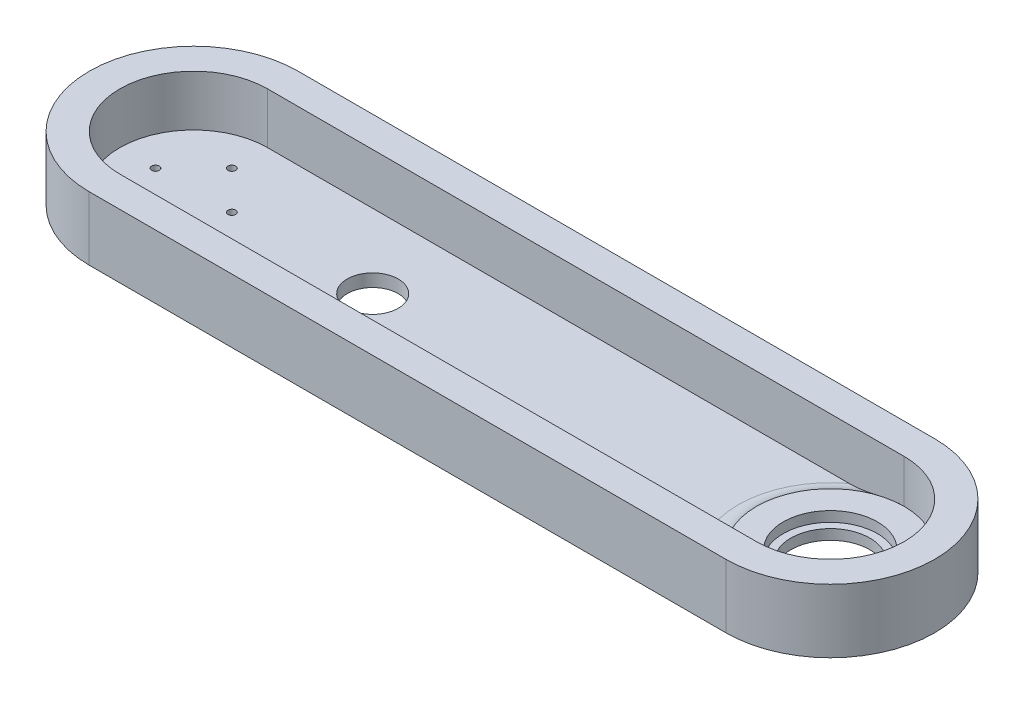
ISO-10303-21;
HEADER;
FILE_DESCRIPTION(('STEP AP214'),'2;1');
FILE_NAME('part.step','',(''),(''),'','','');
FILE_SCHEMA(('AUTOMOTIVE_DESIGN { 1 0 10303 214 1 1 1 1 }'));
ENDSEC;
DATA;
#1=APPLICATION_CONTEXT('core data for automotive mechanical design processes');
#2=APPLICATION_PROTOCOL_DEFINITION('international standard','automotive_design',2000,#1);
#3=PRODUCT_CONTEXT('',#1,'mechanical');
#4=PRODUCT('Part','Part','',(#3));
#5=PRODUCT_RELATED_PRODUCT_CATEGORY('part','',(#4));
#6=PRODUCT_DEFINITION_FORMATION('','',#4);
#7=PRODUCT_DEFINITION_CONTEXT('part definition',#1,'design');
#8=PRODUCT_DEFINITION('design','',#6,#7);
#9=PRODUCT_DEFINITION_SHAPE('','',#8);
#10=(LENGTH_UNIT() NAMED_UNIT(*) SI_UNIT(.MILLI.,.METRE.));
#11=(NAMED_UNIT(*) PLANE_ANGLE_UNIT() SI_UNIT($,.RADIAN.));
#12=(NAMED_UNIT(*) SI_UNIT($,.STERADIAN.) SOLID_ANGLE_UNIT());
#13=UNCERTAINTY_MEASURE_WITH_UNIT(LENGTH_MEASURE(1.E-05),#10,'distance_accuracy_value','');
#14=(GEOMETRIC_REPRESENTATION_CONTEXT(3) GLOBAL_UNCERTAINTY_ASSIGNED_CONTEXT((#13)) GLOBAL_UNIT_ASSIGNED_CONTEXT((#10,
#11,#12)) REPRESENTATION_CONTEXT('',''));
#15=CARTESIAN_POINT('',(0.,0.,0.));
#16=DIRECTION('',(0.,0.,1.));
#17=DIRECTION('',(1.,0.,0.));
#18=AXIS2_PLACEMENT_3D('',#15,#16,#17);
#19=CARTESIAN_POINT('',(0.,0.,0.));
#20=DIRECTION('',(0.,1.,0.));
#21=DIRECTION('',(0.,0.,1.));
#22=AXIS2_PLACEMENT_3D('',#19,#20,#21);
#23=PLANE('',#22);
#24=CARTESIAN_POINT('',(70.3,0.,0.));
#25=DIRECTION('',(0.,1.,0.));
#26=DIRECTION('',(0.,0.,1.));
#27=AXIS2_PLACEMENT_3D('',#24,#25,#26);
#28=CIRCLE('',#27,9.99999999999999);
#29=CARTESIAN_POINT('',(70.3,0.,9.99999999999999));
#30=VERTEX_POINT('',#29);
#31=EDGE_CURVE('E186',#30,#30,#28,.T.);
#32=ORIENTED_EDGE('',*,*,#31,.F.);
#33=EDGE_LOOP('',(#32));
#34=FACE_BOUND('',#33,.T.);
#35=CARTESIAN_POINT('',(15.0000000000004,0.,-4.24488671257339E-13));
#36=DIRECTION('',(0.,1.,0.));
#37=DIRECTION('',(0.,0.,1.));
#38=AXIS2_PLACEMENT_3D('',#35,#36,#37);
#39=CIRCLE('',#38,1.50000000000033);
#40=CARTESIAN_POINT('',(15.0000000000004,0.,1.49999999999991));
#41=VERTEX_POINT('',#40);
#42=EDGE_CURVE('E190',#41,#41,#39,.T.);
#43=ORIENTED_EDGE('',*,*,#42,.F.);
#44=EDGE_LOOP('',(#43));
#45=FACE_BOUND('',#44,.T.);
#46=CARTESIAN_POINT('',(8.48977342514678E-13,0.,15.));
#47=DIRECTION('',(0.,1.,0.));
#48=DIRECTION('',(0.,0.,1.));
#49=AXIS2_PLACEMENT_3D('',#46,#47,#48);
#50=CIRCLE('',#49,1.50000000000091);
#51=CARTESIAN_POINT('',(8.48977342514678E-13,0.,16.5000000000009));
#52=VERTEX_POINT('',#51);
#53=EDGE_CURVE('E194',#52,#52,#50,.T.);
#54=ORIENTED_EDGE('',*,*,#53,.F.);
#55=EDGE_LOOP('',(#54));
#56=FACE_BOUND('',#55,.T.);
#57=CARTESIAN_POINT('',(-14.9999999999996,0.,4.2632564145606E-13));
#58=DIRECTION('',(0.,1.,0.));
#59=DIRECTION('',(0.,0.,1.));
#60=AXIS2_PLACEMENT_3D('',#57,#58,#59);
#61=CIRCLE('',#60,1.50000000000068);
#62=CARTESIAN_POINT('',(-14.9999999999996,0.,1.50000000000111));
#63=VERTEX_POINT('',#62);
#64=EDGE_CURVE('E198',#63,#63,#61,.T.);
#65=ORIENTED_EDGE('',*,*,#64,.F.);
#66=EDGE_LOOP('',(#65));
#67=FACE_BOUND('',#66,.T.);
#68=CARTESIAN_POINT('',(0.,0.,-15.));
#69=DIRECTION('',(0.,1.,0.));
#70=DIRECTION('',(0.,0.,1.));
#71=AXIS2_PLACEMENT_3D('',#68,#69,#70);
#72=CIRCLE('',#71,1.5);
#73=CARTESIAN_POINT('',(0.,0.,-13.5));
#74=VERTEX_POINT('',#73);
#75=EDGE_CURVE('E201',#74,#74,#72,.T.);
#76=ORIENTED_EDGE('',*,*,#75,.F.);
#77=EDGE_LOOP('',(#76));
#78=FACE_BOUND('',#77,.T.);
#79=DIRECTION('',(1.,0.,0.));
#80=VECTOR('',#79,1.);
#81=CARTESIAN_POINT('',(0.,0.,29.));
#82=LINE('',#81,#80);
#83=CARTESIAN_POINT('',(0.,0.,29.));
#84=VERTEX_POINT('',#83);
#85=CARTESIAN_POINT('',(228.431438414779,0.,29.));
#86=VERTEX_POINT('',#85);
#87=EDGE_CURVE('E203',#84,#86,#82,.T.);
#88=ORIENTED_EDGE('',*,*,#87,.T.);
#89=CARTESIAN_POINT('',(250.,0.,0.));
#90=DIRECTION('',(0.,1.,0.));
#91=DIRECTION('',(0.,0.,1.));
#92=AXIS2_PLACEMENT_3D('',#89,#90,#91);
#93=CIRCLE('',#92,36.1414284285429);
#94=CARTESIAN_POINT('',(228.431438414779,0.,-29.));
#95=VERTEX_POINT('',#94);
#96=EDGE_CURVE('E130',#86,#95,#93,.F.);
#97=ORIENTED_EDGE('',*,*,#96,.T.);
#98=DIRECTION('',(-1.,0.,0.));
#99=VECTOR('',#98,1.);
#100=CARTESIAN_POINT('',(0.,0.,-29.));
#101=LINE('',#100,#99);
#102=CARTESIAN_POINT('',(0.,0.,-29.));
#103=VERTEX_POINT('',#102);
#104=EDGE_CURVE('E207',#95,#103,#101,.T.);
#105=ORIENTED_EDGE('',*,*,#104,.T.);
#106=CARTESIAN_POINT('',(0.,0.,0.));
#107=DIRECTION('',(0.,1.,0.));
#108=DIRECTION('',(0.,0.,1.));
#109=AXIS2_PLACEMENT_3D('',#106,#107,#108);
#110=CIRCLE('',#109,29.);
#111=EDGE_CURVE('E205',#103,#84,#110,.T.);
#112=ORIENTED_EDGE('',*,*,#111,.T.);
#113=EDGE_LOOP('',(#88,#97,#105,#112));
#114=FACE_BOUND('',#113,.T.);
#115=ADVANCED_FACE('F35',(#34,#45,#56,#67,#78,#114),#23,.T.);
#116=CARTESIAN_POINT('',(0.,20.,0.));
#117=DIRECTION('',(0.,1.,0.));
#118=DIRECTION('',(0.,0.,1.));
#119=AXIS2_PLACEMENT_3D('',#116,#117,#118);
#120=PLANE('',#119);
#121=CARTESIAN_POINT('',(0.,20.,0.));
#122=DIRECTION('',(0.,1.,0.));
#123=DIRECTION('',(0.,0.,1.));
#124=AXIS2_PLACEMENT_3D('',#121,#122,#123);
#125=CIRCLE('',#124,41.);
#126=CARTESIAN_POINT('',(0.,20.,-41.));
#127=VERTEX_POINT('',#126);
#128=CARTESIAN_POINT('',(0.,20.,41.));
#129=VERTEX_POINT('',#128);
#130=EDGE_CURVE('E221',#127,#129,#125,.T.);
#131=ORIENTED_EDGE('',*,*,#130,.T.);
#132=DIRECTION('',(1.,0.,0.));
#133=VECTOR('',#132,1.);
#134=CARTESIAN_POINT('',(0.,20.,41.));
#135=LINE('',#134,#133);
#136=CARTESIAN_POINT('',(250.,20.,41.));
#137=VERTEX_POINT('',#136);
#138=EDGE_CURVE('E224',#129,#137,#135,.T.);
#139=ORIENTED_EDGE('',*,*,#138,.T.);
#140=CARTESIAN_POINT('',(250.,20.,0.));
#141=DIRECTION('',(0.,1.,0.));
#142=DIRECTION('',(0.,0.,1.));
#143=AXIS2_PLACEMENT_3D('',#140,#141,#142);
#144=CIRCLE('',#143,41.);
#145=CARTESIAN_POINT('',(250.,20.,-41.));
#146=VERTEX_POINT('',#145);
#147=EDGE_CURVE('E226',#137,#146,#144,.T.);
#148=ORIENTED_EDGE('',*,*,#147,.T.);
#149=DIRECTION('',(-1.,0.,0.));
#150=VECTOR('',#149,1.);
#151=CARTESIAN_POINT('',(0.,20.,-41.));
#152=LINE('',#151,#150);
#153=EDGE_CURVE('E228',#146,#127,#152,.T.);
#154=ORIENTED_EDGE('',*,*,#153,.T.);
#155=EDGE_LOOP('',(#131,#139,#148,#154));
#156=FACE_BOUND('',#155,.T.);
#157=DIRECTION('',(1.,0.,0.));
#158=VECTOR('',#157,1.);
#159=CARTESIAN_POINT('',(0.,20.,29.));
#160=LINE('',#159,#158);
#161=CARTESIAN_POINT('',(0.,20.,29.));
#162=VERTEX_POINT('',#161);
#163=CARTESIAN_POINT('',(250.,20.,29.));
#164=VERTEX_POINT('',#163);
#165=EDGE_CURVE('E127',#162,#164,#160,.T.);
#166=ORIENTED_EDGE('',*,*,#165,.F.);
#167=CARTESIAN_POINT('',(0.,20.,0.));
#168=DIRECTION('',(0.,1.,0.));
#169=DIRECTION('',(0.,0.,1.));
#170=AXIS2_PLACEMENT_3D('',#167,#168,#169);
#171=CIRCLE('',#170,29.);
#172=CARTESIAN_POINT('',(0.,20.,-29.));
#173=VERTEX_POINT('',#172);
#174=EDGE_CURVE('E209',#173,#162,#171,.T.);
#175=ORIENTED_EDGE('',*,*,#174,.F.);
#176=DIRECTION('',(-1.,0.,0.));
#177=VECTOR('',#176,1.);
#178=CARTESIAN_POINT('',(0.,20.,-29.));
#179=LINE('',#178,#177);
#180=CARTESIAN_POINT('',(250.,20.,-29.));
#181=VERTEX_POINT('',#180);
#182=EDGE_CURVE('E218',#181,#173,#179,.T.);
#183=ORIENTED_EDGE('',*,*,#182,.F.);
#184=CARTESIAN_POINT('',(250.,20.,0.));
#185=DIRECTION('',(0.,1.,0.));
#186=DIRECTION('',(0.,0.,1.));
#187=AXIS2_PLACEMENT_3D('',#184,#185,#186);
#188=CIRCLE('',#187,29.);
#189=EDGE_CURVE('E260',#164,#181,#188,.T.);
#190=ORIENTED_EDGE('',*,*,#189,.F.);
#191=EDGE_LOOP('',(#166,#175,#183,#190));
#192=FACE_BOUND('',#191,.T.);
#193=ADVANCED_FACE('F160',(#156,#192),#120,.T.);
#194=CARTESIAN_POINT('',(0.,20.,0.));
#195=DIRECTION('',(0.,-1.,0.));
#196=DIRECTION('',(0.,0.,-1.));
#197=AXIS2_PLACEMENT_3D('',#194,#195,#196);
#198=CYLINDRICAL_SURFACE('',#197,41.);
#199=DIRECTION('',(0.,-1.,0.));
#200=VECTOR('',#199,1.);
#201=CARTESIAN_POINT('',(0.,20.,-41.));
#202=LINE('',#201,#200);
#203=CARTESIAN_POINT('',(0.,-5.,-41.));
#204=VERTEX_POINT('',#203);
#205=EDGE_CURVE('E230',#127,#204,#202,.T.);
#206=ORIENTED_EDGE('',*,*,#205,.T.);
#207=CARTESIAN_POINT('',(0.,-5.,0.));
#208=DIRECTION('',(0.,1.,0.));
#209=DIRECTION('',(0.,0.,1.));
#210=AXIS2_PLACEMENT_3D('',#207,#208,#209);
#211=CIRCLE('',#210,41.);
#212=CARTESIAN_POINT('',(0.,-5.,41.));
#213=VERTEX_POINT('',#212);
#214=EDGE_CURVE('E211',#204,#213,#211,.T.);
#215=ORIENTED_EDGE('',*,*,#214,.T.);
#216=DIRECTION('',(0.,-1.,0.));
#217=VECTOR('',#216,1.);
#218=CARTESIAN_POINT('',(0.,20.,41.));
#219=LINE('',#218,#217);
#220=EDGE_CURVE('E133',#129,#213,#219,.T.);
#221=ORIENTED_EDGE('',*,*,#220,.F.);
#222=ORIENTED_EDGE('',*,*,#130,.F.);
#223=EDGE_LOOP('',(#206,#215,#221,#222));
#224=FACE_BOUND('',#223,.T.);
#225=ADVANCED_FACE('F163',(#224),#198,.T.);
#226=CARTESIAN_POINT('',(0.,20.,41.));
#227=DIRECTION('',(0.,0.,-1.));
#228=DIRECTION('',(-1.,0.,0.));
#229=AXIS2_PLACEMENT_3D('',#226,#227,#228);
#230=PLANE('',#229);
#231=ORIENTED_EDGE('',*,*,#220,.T.);
#232=DIRECTION('',(1.,0.,0.));
#233=VECTOR('',#232,1.);
#234=CARTESIAN_POINT('',(0.,-5.,41.));
#235=LINE('',#234,#233);
#236=CARTESIAN_POINT('',(250.,-5.,41.));
#237=VERTEX_POINT('',#236);
#238=EDGE_CURVE('E245',#213,#237,#235,.T.);
#239=ORIENTED_EDGE('',*,*,#238,.T.);
#240=DIRECTION('',(0.,-1.,0.));
#241=VECTOR('',#240,1.);
#242=CARTESIAN_POINT('',(250.,20.,41.));
#243=LINE('',#242,#241);
#244=EDGE_CURVE('E135',#137,#237,#243,.T.);
#245=ORIENTED_EDGE('',*,*,#244,.F.);
#246=ORIENTED_EDGE('',*,*,#138,.F.);
#247=EDGE_LOOP('',(#231,#239,#245,#246));
#248=FACE_BOUND('',#247,.T.);
#249=ADVANCED_FACE('F171',(#248),#230,.F.);
#250=CARTESIAN_POINT('',(250.,20.,0.));
#251=DIRECTION('',(0.,-1.,0.));
#252=DIRECTION('',(0.,0.,-1.));
#253=AXIS2_PLACEMENT_3D('',#250,#251,#252);
#254=CYLINDRICAL_SURFACE('',#253,41.);
#255=ORIENTED_EDGE('',*,*,#244,.T.);
#256=CARTESIAN_POINT('',(250.,-5.,0.));
#257=DIRECTION('',(0.,1.,0.));
#258=DIRECTION('',(0.,0.,1.));
#259=AXIS2_PLACEMENT_3D('',#256,#257,#258);
#260=CIRCLE('',#259,41.);
#261=CARTESIAN_POINT('',(250.,-5.,-41.));
#262=VERTEX_POINT('',#261);
#263=EDGE_CURVE('E239',#237,#262,#260,.T.);
#264=ORIENTED_EDGE('',*,*,#263,.T.);
#265=DIRECTION('',(0.,-1.,0.));
#266=VECTOR('',#265,1.);
#267=CARTESIAN_POINT('',(250.,20.,-41.));
#268=LINE('',#267,#266);
#269=EDGE_CURVE('E232',#146,#262,#268,.T.);
#270=ORIENTED_EDGE('',*,*,#269,.F.);
#271=ORIENTED_EDGE('',*,*,#147,.F.);
#272=EDGE_LOOP('',(#255,#264,#270,#271));
#273=FACE_BOUND('',#272,.T.);
#274=ADVANCED_FACE('F167',(#273),#254,.T.);
#275=CARTESIAN_POINT('',(0.,20.,-41.));
#276=DIRECTION('',(0.,0.,1.));
#277=DIRECTION('',(1.,0.,0.));
#278=AXIS2_PLACEMENT_3D('',#275,#276,#277);
#279=PLANE('',#278);
#280=ORIENTED_EDGE('',*,*,#269,.T.);
#281=DIRECTION('',(1.,0.,0.));
#282=VECTOR('',#281,1.);
#283=CARTESIAN_POINT('',(0.,-5.,-41.));
#284=LINE('',#283,#282);
#285=EDGE_CURVE('E248',#204,#262,#284,.T.);
#286=ORIENTED_EDGE('',*,*,#285,.F.);
#287=ORIENTED_EDGE('',*,*,#205,.F.);
#288=ORIENTED_EDGE('',*,*,#153,.F.);
#289=EDGE_LOOP('',(#280,#286,#287,#288));
#290=FACE_BOUND('',#289,.T.);
#291=ADVANCED_FACE('F158',(#290),#279,.F.);
#292=CARTESIAN_POINT('',(0.,20.,0.));
#293=DIRECTION('',(0.,-1.,0.));
#294=DIRECTION('',(0.,0.,-1.));
#295=AXIS2_PLACEMENT_3D('',#292,#293,#294);
#296=CYLINDRICAL_SURFACE('',#295,29.);
#297=ORIENTED_EDGE('',*,*,#111,.F.);
#298=DIRECTION('',(0.,-1.,0.));
#299=VECTOR('',#298,1.);
#300=CARTESIAN_POINT('',(0.,20.,-29.));
#301=LINE('',#300,#299);
#302=EDGE_CURVE('E215',#173,#103,#301,.T.);
#303=ORIENTED_EDGE('',*,*,#302,.F.);
#304=ORIENTED_EDGE('',*,*,#174,.T.);
#305=DIRECTION('',(0.,-1.,0.));
#306=VECTOR('',#305,1.);
#307=CARTESIAN_POINT('',(0.,20.,29.));
#308=LINE('',#307,#306);
#309=EDGE_CURVE('E128',#162,#84,#308,.T.);
#310=ORIENTED_EDGE('',*,*,#309,.T.);
#311=EDGE_LOOP('',(#297,#303,#304,#310));
#312=FACE_BOUND('',#311,.T.);
#313=ADVANCED_FACE('F155',(#312),#296,.F.);
#314=CARTESIAN_POINT('',(0.,20.,29.));
#315=DIRECTION('',(0.,0.,-1.));
#316=DIRECTION('',(-1.,0.,0.));
#317=AXIS2_PLACEMENT_3D('',#314,#315,#316);
#318=PLANE('',#317);
#319=DIRECTION('',(0.,-1.,0.));
#320=VECTOR('',#319,1.);
#321=CARTESIAN_POINT('',(250.,20.,29.));
#322=LINE('',#321,#320);
#323=CARTESIAN_POINT('',(250.,3.,29.));
#324=VERTEX_POINT('',#323);
#325=EDGE_CURVE('E120',#164,#324,#322,.T.);
#326=ORIENTED_EDGE('',*,*,#325,.T.);
#327=CARTESIAN_POINT('',(250.,3.,29.));
#328=CARTESIAN_POINT('',(249.832493377356,3.00000367263061,29.));
#329=CARTESIAN_POINT('',(249.664990380621,2.9985188998757,29.));
#330=CARTESIAN_POINT('',(249.330039269559,2.99260478049942,29.));
#331=CARTESIAN_POINT('',(249.162591154308,2.98817548631364,29.));
#332=CARTESIAN_POINT('',(248.660485564545,2.97052251778616,29.));
#333=CARTESIAN_POINT('',(248.325972797857,2.95293372283741,29.));
#334=CARTESIAN_POINT('',(247.658627091689,2.90682313871172,29.));
#335=CARTESIAN_POINT('',(247.325792055736,2.87833103675042,29.));
#336=CARTESIAN_POINT('',(246.66111223066,2.81140950416254,29.));
#337=CARTESIAN_POINT('',(246.329267499912,2.77297949898823,29.));
#338=CARTESIAN_POINT('',(245.666817846843,2.687443630777,29.));
#339=CARTESIAN_POINT('',(245.336212562984,2.64034053760958,29.));
#340=CARTESIAN_POINT('',(244.67613608256,2.53884149075314,29.));
#341=CARTESIAN_POINT('',(244.346664878401,2.48444558599467,29.));
#342=CARTESIAN_POINT('',(243.359155528962,2.3123953016813,29.));
#343=CARTESIAN_POINT('',(242.702660035545,2.18596637017266,29.));
#344=CARTESIAN_POINT('',(241.485079640582,1.9399674063863,29.));
#345=CARTESIAN_POINT('',(240.923664748939,1.82196657385981,29.));
#346=CARTESIAN_POINT('',(239.801276777676,1.58383209028963,29.));
#347=CARTESIAN_POINT('',(239.24030370541,1.46369840449079,29.));
#348=CARTESIAN_POINT('',(238.11825457787,1.22748824284378,29.));
#349=CARTESIAN_POINT('',(237.557179606503,1.11140669088967,29.));
#350=CARTESIAN_POINT('',(236.433103705994,0.888636585884137,29.));
#351=CARTESIAN_POINT('',(235.870102667029,0.781948578042807,29.));
#352=CARTESIAN_POINT('',(234.739695176278,0.582831670789539,29.));
#353=CARTESIAN_POINT('',(234.172280414024,0.490449095875529,29.));
#354=CARTESIAN_POINT('',(233.034603708037,0.325419015592739,29.));
#355=CARTESIAN_POINT('',(232.464342082054,0.252769355783526,29.));
#356=CARTESIAN_POINT('',(231.318178299336,0.131906466672462,29.));
#357=CARTESIAN_POINT('',(230.742262210227,0.0838200060385131,29.));
#358=CARTESIAN_POINT('',(229.588148024831,0.0178691349203777,29.));
#359=CARTESIAN_POINT('',(229.009948180689,3.61368821550616E-05,29.));
#360=CARTESIAN_POINT('',(228.431438414779,0.,29.));
#361=B_SPLINE_CURVE_WITH_KNOTS('',3,(#327,#328,#329,#330,#331,#332,#333,#334,#335,#336,#337,
#338,#339,#340,#341,#342,#343,#344,#345,#346,#347,#348,#349,#350,#351,#352,#353,#354,#355,#356,
#357,#358,#359,#360),.UNSPECIFIED.,.F.,.F.,(4,2,2,2,2,2,2,2,2,2,2,2,2,2,2,2,4),(0.,
0.502506265709881,1.00500358310246,2.00971623130642,3.01171251944555,4.0137667497312,
5.01550151358301,6.01722955671074,8.02261757938016,9.74366545617356,11.4647414034875,
13.1835777648582,14.9025138234281,16.6269047818956,18.3511073955454,20.0841207854072,
21.8189324800552),.UNSPECIFIED.);
#362=EDGE_CURVE('E11',#324,#86,#361,.T.);
#363=ORIENTED_EDGE('',*,*,#362,.T.);
#364=ORIENTED_EDGE('',*,*,#87,.F.);
#365=ORIENTED_EDGE('',*,*,#309,.F.);
#366=ORIENTED_EDGE('',*,*,#165,.T.);
#367=EDGE_LOOP('',(#326,#363,#364,#365,#366));
#368=FACE_BOUND('',#367,.T.);
#369=ADVANCED_FACE('F124',(#368),#318,.T.);
#370=CARTESIAN_POINT('',(250.,20.,0.));
#371=DIRECTION('',(0.,-1.,0.));
#372=DIRECTION('',(0.,0.,-1.));
#373=AXIS2_PLACEMENT_3D('',#370,#371,#372);
#374=CYLINDRICAL_SURFACE('',#373,29.);
#375=CARTESIAN_POINT('',(250.,3.,0.));
#376=DIRECTION('',(0.,1.,0.));
#377=DIRECTION('',(0.,0.,1.));
#378=AXIS2_PLACEMENT_3D('',#375,#376,#377);
#379=CIRCLE('',#378,29.);
#380=CARTESIAN_POINT('',(250.,3.,-29.));
#381=VERTEX_POINT('',#380);
#382=EDGE_CURVE('E112',#324,#381,#379,.T.);
#383=ORIENTED_EDGE('',*,*,#382,.F.);
#384=ORIENTED_EDGE('',*,*,#325,.F.);
#385=ORIENTED_EDGE('',*,*,#189,.T.);
#386=DIRECTION('',(0.,-1.,0.));
#387=VECTOR('',#386,1.);
#388=CARTESIAN_POINT('',(250.,20.,-29.));
#389=LINE('',#388,#387);
#390=EDGE_CURVE('E122',#181,#381,#389,.T.);
#391=ORIENTED_EDGE('',*,*,#390,.T.);
#392=EDGE_LOOP('',(#383,#384,#385,#391));
#393=FACE_BOUND('',#392,.T.);
#394=ADVANCED_FACE('F118',(#393),#374,.F.);
#395=CARTESIAN_POINT('',(0.,20.,-29.));
#396=DIRECTION('',(0.,0.,1.));
#397=DIRECTION('',(1.,0.,0.));
#398=AXIS2_PLACEMENT_3D('',#395,#396,#397);
#399=PLANE('',#398);
#400=ORIENTED_EDGE('',*,*,#104,.F.);
#401=CARTESIAN_POINT('',(228.431438414779,0.,-29.));
#402=CARTESIAN_POINT('',(228.7712509574,5.30773564091231E-06,-29.));
#403=CARTESIAN_POINT('',(229.111011404756,0.00616809285598318,-29.));
#404=CARTESIAN_POINT('',(229.790063460882,0.0297169154421981,-29.));
#405=CARTESIAN_POINT('',(230.12935516613,0.0471001277119732,-29.));
#406=CARTESIAN_POINT('',(231.145021725049,0.114368246206919,-29.));
#407=CARTESIAN_POINT('',(231.820408098775,0.179379530768059,-29.));
#408=CARTESIAN_POINT('',(233.166581031963,0.341322058111444,-29.));
#409=CARTESIAN_POINT('',(233.837370986746,0.438226368006113,-29.));
#410=CARTESIAN_POINT('',(235.175465990828,0.655818383972155,-29.));
#411=CARTESIAN_POINT('',(235.842768362181,0.776522207382179,-29.));
#412=CARTESIAN_POINT('',(237.067227847358,1.01257222818366,-29.));
#413=CARTESIAN_POINT('',(237.624832005435,1.12565569701959,-29.));
#414=CARTESIAN_POINT('',(238.738898691866,1.35731126230573,-29.));
#415=CARTESIAN_POINT('',(239.295361193068,1.47588348775472,-29.));
#416=CARTESIAN_POINT('',(240.407722646888,1.71266395535803,-29.));
#417=CARTESIAN_POINT('',(240.963621546068,1.83087245442479,-29.));
#418=CARTESIAN_POINT('',(242.076843467326,2.06078866897682,-29.));
#419=CARTESIAN_POINT('',(242.634166613534,2.17249579616322,-29.));
#420=CARTESIAN_POINT('',(243.75274612407,2.38278730883891,-29.));
#421=CARTESIAN_POINT('',(244.314008777347,2.48133889697814,-29.));
#422=CARTESIAN_POINT('',(245.439682547898,2.65769097186664,-29.));
#423=CARTESIAN_POINT('',(246.00409235969,2.73549949164326,-29.));
#424=CARTESIAN_POINT('',(246.854489630497,2.83177237456654,-29.));
#425=CARTESIAN_POINT('',(247.139322428893,2.86050396734676,-29.));
#426=CARTESIAN_POINT('',(247.709654232686,2.91033660830311,-29.));
#427=CARTESIAN_POINT('',(247.995153217051,2.93143789418972,-29.));
#428=CARTESIAN_POINT('',(248.567059884556,2.96546191387092,-29.));
#429=CARTESIAN_POINT('',(248.853468285594,2.97837268727966,-29.));
#430=CARTESIAN_POINT('',(249.426581429478,2.9956631071147,-29.));
#431=CARTESIAN_POINT('',(249.713286208416,3.00004155034541,-29.));
#432=CARTESIAN_POINT('',(250.,2.99999999999964,-29.));
#433=B_SPLINE_CURVE_WITH_KNOTS('',3,(#401,#402,#403,#404,#405,#406,#407,#408,#409,#410,#411,
#412,#413,#414,#415,#416,#417,#418,#419,#420,#421,#422,#423,#424,#425,#426,#427,#428,#429,#430,
#431,#432),.UNSPECIFIED.,.F.,.F.,(4,2,2,2,2,2,2,2,2,2,2,2,2,2,2,4),(0.,1.01929970871869,
2.03834286759517,4.07277543747311,6.10549436775049,8.13959463914237,9.84641472354875,
11.5532749426588,13.2582575624579,14.9633942243308,16.6727054911769,18.3813538398808,
19.2401015696126,20.098822544074,20.9587946166991,21.8188879504262),.UNSPECIFIED.);
#434=EDGE_CURVE('E48',#95,#381,#433,.T.);
#435=ORIENTED_EDGE('',*,*,#434,.T.);
#436=ORIENTED_EDGE('',*,*,#390,.F.);
#437=ORIENTED_EDGE('',*,*,#182,.T.);
#438=ORIENTED_EDGE('',*,*,#302,.T.);
#439=EDGE_LOOP('',(#400,#435,#436,#437,#438));
#440=FACE_BOUND('',#439,.T.);
#441=ADVANCED_FACE('F143',(#440),#399,.T.);
#442=CARTESIAN_POINT('',(0.,-5.,0.));
#443=DIRECTION('',(0.,1.,0.));
#444=DIRECTION('',(0.,0.,1.));
#445=AXIS2_PLACEMENT_3D('',#442,#443,#444);
#446=PLANE('',#445);
#447=CARTESIAN_POINT('',(70.3,-5.,0.));
#448=DIRECTION('',(0.,1.,0.));
#449=DIRECTION('',(0.,0.,1.));
#450=AXIS2_PLACEMENT_3D('',#447,#448,#449);
#451=CIRCLE('',#450,9.99999999999999);
#452=CARTESIAN_POINT('',(70.3,-5.,9.99999999999999));
#453=VERTEX_POINT('',#452);
#454=EDGE_CURVE('E290',#453,#453,#451,.T.);
#455=ORIENTED_EDGE('',*,*,#454,.T.);
#456=EDGE_LOOP('',(#455));
#457=FACE_BOUND('',#456,.T.);
#458=CARTESIAN_POINT('',(250.,-5.,0.));
#459=DIRECTION('',(0.,1.,0.));
#460=DIRECTION('',(0.,0.,1.));
#461=AXIS2_PLACEMENT_3D('',#458,#459,#460);
#462=CIRCLE('',#461,15.5);
#463=CARTESIAN_POINT('',(250.,-5.,15.5));
#464=VERTEX_POINT('',#463);
#465=EDGE_CURVE('E286',#464,#464,#462,.T.);
#466=ORIENTED_EDGE('',*,*,#465,.T.);
#467=EDGE_LOOP('',(#466));
#468=FACE_BOUND('',#467,.T.);
#469=CARTESIAN_POINT('',(15.0000000000004,-5.,-4.24488671257339E-13));
#470=DIRECTION('',(0.,1.,0.));
#471=DIRECTION('',(0.,0.,1.));
#472=AXIS2_PLACEMENT_3D('',#469,#470,#471);
#473=CIRCLE('',#472,1.50000000000033);
#474=CARTESIAN_POINT('',(15.0000000000004,-5.,1.49999999999991));
#475=VERTEX_POINT('',#474);
#476=EDGE_CURVE('E273',#475,#475,#473,.T.);
#477=ORIENTED_EDGE('',*,*,#476,.T.);
#478=EDGE_LOOP('',(#477));
#479=FACE_BOUND('',#478,.T.);
#480=CARTESIAN_POINT('',(8.48977342514678E-13,-5.,15.));
#481=DIRECTION('',(0.,1.,0.));
#482=DIRECTION('',(0.,0.,1.));
#483=AXIS2_PLACEMENT_3D('',#480,#481,#482);
#484=CIRCLE('',#483,1.50000000000091);
#485=CARTESIAN_POINT('',(8.48977342514678E-13,-5.,16.5000000000009));
#486=VERTEX_POINT('',#485);
#487=EDGE_CURVE('E276',#486,#486,#484,.T.);
#488=ORIENTED_EDGE('',*,*,#487,.T.);
#489=EDGE_LOOP('',(#488));
#490=FACE_BOUND('',#489,.T.);
#491=CARTESIAN_POINT('',(-14.9999999999996,-5.,4.2632564145606E-13));
#492=DIRECTION('',(0.,1.,0.));
#493=DIRECTION('',(0.,0.,1.));
#494=AXIS2_PLACEMENT_3D('',#491,#492,#493);
#495=CIRCLE('',#494,1.50000000000068);
#496=CARTESIAN_POINT('',(-14.9999999999996,-5.,1.50000000000111));
#497=VERTEX_POINT('',#496);
#498=EDGE_CURVE('E123',#497,#497,#495,.T.);
#499=ORIENTED_EDGE('',*,*,#498,.T.);
#500=EDGE_LOOP('',(#499));
#501=FACE_BOUND('',#500,.T.);
#502=CARTESIAN_POINT('',(0.,-5.,-15.));
#503=DIRECTION('',(0.,1.,0.));
#504=DIRECTION('',(0.,0.,1.));
#505=AXIS2_PLACEMENT_3D('',#502,#503,#504);
#506=CIRCLE('',#505,1.5);
#507=CARTESIAN_POINT('',(0.,-5.,-13.5));
#508=VERTEX_POINT('',#507);
#509=EDGE_CURVE('E252',#508,#508,#506,.T.);
#510=ORIENTED_EDGE('',*,*,#509,.T.);
#511=EDGE_LOOP('',(#510));
#512=FACE_BOUND('',#511,.T.);
#513=ORIENTED_EDGE('',*,*,#238,.F.);
#514=ORIENTED_EDGE('',*,*,#214,.F.);
#515=ORIENTED_EDGE('',*,*,#285,.T.);
#516=ORIENTED_EDGE('',*,*,#263,.F.);
#517=EDGE_LOOP('',(#513,#514,#515,#516));
#518=FACE_BOUND('',#517,.T.);
#519=ADVANCED_FACE('F148',(#457,#468,#479,#490,#501,#512,#518),#446,.F.);
#520=CARTESIAN_POINT('',(0.,-5.,-15.));
#521=DIRECTION('',(0.,1.,0.));
#522=DIRECTION('',(0.,0.,1.));
#523=AXIS2_PLACEMENT_3D('',#520,#521,#522);
#524=CYLINDRICAL_SURFACE('',#523,1.5);
#525=ORIENTED_EDGE('',*,*,#75,.T.);
#526=EDGE_LOOP('',(#525));
#527=FACE_BOUND('',#526,.T.);
#528=ORIENTED_EDGE('',*,*,#509,.F.);
#529=EDGE_LOOP('',(#528));
#530=FACE_BOUND('',#529,.T.);
#531=ADVANCED_FACE('F330',(#527,#530),#524,.F.);
#532=CARTESIAN_POINT('',(-14.9999999999996,-5.,4.2632564145606E-13));
#533=DIRECTION('',(0.,1.,0.));
#534=DIRECTION('',(0.,0.,1.));
#535=AXIS2_PLACEMENT_3D('',#532,#533,#534);
#536=CYLINDRICAL_SURFACE('',#535,1.50000000000068);
#537=ORIENTED_EDGE('',*,*,#64,.T.);
#538=EDGE_LOOP('',(#537));
#539=FACE_BOUND('',#538,.T.);
#540=ORIENTED_EDGE('',*,*,#498,.F.);
#541=EDGE_LOOP('',(#540));
#542=FACE_BOUND('',#541,.T.);
#543=ADVANCED_FACE('F326',(#539,#542),#536,.F.);
#544=CARTESIAN_POINT('',(8.48977342514678E-13,-5.,15.));
#545=DIRECTION('',(0.,1.,0.));
#546=DIRECTION('',(0.,0.,1.));
#547=AXIS2_PLACEMENT_3D('',#544,#545,#546);
#548=CYLINDRICAL_SURFACE('',#547,1.50000000000091);
#549=ORIENTED_EDGE('',*,*,#53,.T.);
#550=EDGE_LOOP('',(#549));
#551=FACE_BOUND('',#550,.T.);
#552=ORIENTED_EDGE('',*,*,#487,.F.);
#553=EDGE_LOOP('',(#552));
#554=FACE_BOUND('',#553,.T.);
#555=ADVANCED_FACE('F322',(#551,#554),#548,.F.);
#556=CARTESIAN_POINT('',(15.0000000000004,-5.,-4.24488671257339E-13));
#557=DIRECTION('',(0.,1.,0.));
#558=DIRECTION('',(0.,0.,1.));
#559=AXIS2_PLACEMENT_3D('',#556,#557,#558);
#560=CYLINDRICAL_SURFACE('',#559,1.50000000000033);
#561=ORIENTED_EDGE('',*,*,#42,.T.);
#562=EDGE_LOOP('',(#561));
#563=FACE_BOUND('',#562,.T.);
#564=ORIENTED_EDGE('',*,*,#476,.F.);
#565=EDGE_LOOP('',(#564));
#566=FACE_BOUND('',#565,.T.);
#567=ADVANCED_FACE('F318',(#563,#566),#560,.F.);
#568=CARTESIAN_POINT('',(250.,3.,0.));
#569=DIRECTION('',(0.,1.,0.));
#570=DIRECTION('',(0.,0.,1.));
#571=AXIS2_PLACEMENT_3D('',#568,#569,#570);
#572=PLANE('',#571);
#573=CARTESIAN_POINT('',(250.,3.,0.));
#574=DIRECTION('',(0.,1.,0.));
#575=DIRECTION('',(0.,0.,1.));
#576=AXIS2_PLACEMENT_3D('',#573,#574,#575);
#577=CIRCLE('',#576,18.5);
#578=CARTESIAN_POINT('',(250.,3.,18.5));
#579=VERTEX_POINT('',#578);
#580=EDGE_CURVE('E281',#579,#579,#577,.T.);
#581=ORIENTED_EDGE('',*,*,#580,.F.);
#582=EDGE_LOOP('',(#581));
#583=FACE_BOUND('',#582,.T.);
#584=ORIENTED_EDGE('',*,*,#382,.T.);
#585=EDGE_CURVE('E109',#381,#324,#379,.T.);
#586=ORIENTED_EDGE('',*,*,#585,.T.);
#587=EDGE_LOOP('',(#584,#586));
#588=FACE_BOUND('',#587,.T.);
#589=ADVANCED_FACE('F111',(#583,#588),#572,.T.);
#590=CARTESIAN_POINT('',(250.,-1.,0.));
#591=DIRECTION('',(0.,1.,0.));
#592=DIRECTION('',(0.,0.,1.));
#593=AXIS2_PLACEMENT_3D('',#590,#591,#592);
#594=CYLINDRICAL_SURFACE('',#593,18.5);
#595=CARTESIAN_POINT('',(250.,-1.,0.));
#596=DIRECTION('',(0.,1.,0.));
#597=DIRECTION('',(0.,0.,1.));
#598=AXIS2_PLACEMENT_3D('',#595,#596,#597);
#599=CIRCLE('',#598,18.5);
#600=CARTESIAN_POINT('',(250.,-1.,18.5));
#601=VERTEX_POINT('',#600);
#602=EDGE_CURVE('E114',#601,#601,#599,.T.);
#603=ORIENTED_EDGE('',*,*,#602,.F.);
#604=EDGE_LOOP('',(#603));
#605=FACE_BOUND('',#604,.T.);
#606=ORIENTED_EDGE('',*,*,#580,.T.);
#607=EDGE_LOOP('',(#606));
#608=FACE_BOUND('',#607,.T.);
#609=ADVANCED_FACE('F311',(#605,#608),#594,.F.);
#610=CARTESIAN_POINT('',(250.,-1.,0.));
#611=DIRECTION('',(0.,1.,0.));
#612=DIRECTION('',(0.,0.,1.));
#613=AXIS2_PLACEMENT_3D('',#610,#611,#612);
#614=PLANE('',#613);
#615=CARTESIAN_POINT('',(250.,-1.,0.));
#616=DIRECTION('',(0.,1.,0.));
#617=DIRECTION('',(0.,0.,1.));
#618=AXIS2_PLACEMENT_3D('',#615,#616,#617);
#619=CIRCLE('',#618,15.5);
#620=CARTESIAN_POINT('',(250.,-1.,15.5));
#621=VERTEX_POINT('',#620);
#622=EDGE_CURVE('E138',#621,#621,#619,.T.);
#623=ORIENTED_EDGE('',*,*,#622,.F.);
#624=EDGE_LOOP('',(#623));
#625=FACE_BOUND('',#624,.T.);
#626=ORIENTED_EDGE('',*,*,#602,.T.);
#627=EDGE_LOOP('',(#626));
#628=FACE_BOUND('',#627,.T.);
#629=ADVANCED_FACE('F307',(#625,#628),#614,.T.);
#630=CARTESIAN_POINT('',(250.,-5.,0.));
#631=DIRECTION('',(0.,1.,0.));
#632=DIRECTION('',(0.,0.,1.));
#633=AXIS2_PLACEMENT_3D('',#630,#631,#632);
#634=CYLINDRICAL_SURFACE('',#633,15.5);
#635=ORIENTED_EDGE('',*,*,#622,.T.);
#636=EDGE_LOOP('',(#635));
#637=FACE_BOUND('',#636,.T.);
#638=ORIENTED_EDGE('',*,*,#465,.F.);
#639=EDGE_LOOP('',(#638));
#640=FACE_BOUND('',#639,.T.);
#641=ADVANCED_FACE('F303',(#637,#640),#634,.F.);
#642=CARTESIAN_POINT('',(250.,10.,0.));
#643=DIRECTION('',(0.,1.,0.));
#644=DIRECTION('',(0.,0.,1.));
#645=AXIS2_PLACEMENT_3D('',#642,#643,#644);
#646=TOROIDAL_SURFACE('',#645,36.1414284285429,10.);
#647=ORIENTED_EDGE('',*,*,#362,.F.);
#648=ORIENTED_EDGE('',*,*,#585,.F.);
#649=ORIENTED_EDGE('',*,*,#434,.F.);
#650=ORIENTED_EDGE('',*,*,#96,.F.);
#651=EDGE_LOOP('',(#647,#648,#649,#650));
#652=FACE_BOUND('',#651,.T.);
#653=ADVANCED_FACE('F37',(#652),#646,.F.);
#654=CARTESIAN_POINT('',(70.3,-5.,0.));
#655=DIRECTION('',(0.,1.,0.));
#656=DIRECTION('',(0.,0.,1.));
#657=AXIS2_PLACEMENT_3D('',#654,#655,#656);
#658=CYLINDRICAL_SURFACE('',#657,9.99999999999999);
#659=ORIENTED_EDGE('',*,*,#31,.T.);
#660=EDGE_LOOP('',(#659));
#661=FACE_BOUND('',#660,.T.);
#662=ORIENTED_EDGE('',*,*,#454,.F.);
#663=EDGE_LOOP('',(#662));
#664=FACE_BOUND('',#663,.T.);
#665=ADVANCED_FACE('F296',(#661,#664),#658,.F.);
#666=CLOSED_SHELL('',(#115,#193,#225,#249,#274,#291,#313,#369,#394,#441,#519,#531,#543,#555,
#567,#589,#609,#629,#641,#653,#665));
#667=MANIFOLD_SOLID_BREP('B2',#666);
#668=ADVANCED_BREP_SHAPE_REPRESENTATION('',(#18,#667),#14);
#669=SHAPE_DEFINITION_REPRESENTATION(#9,#668);
ENDSEC;
END-ISO-10303-21;
